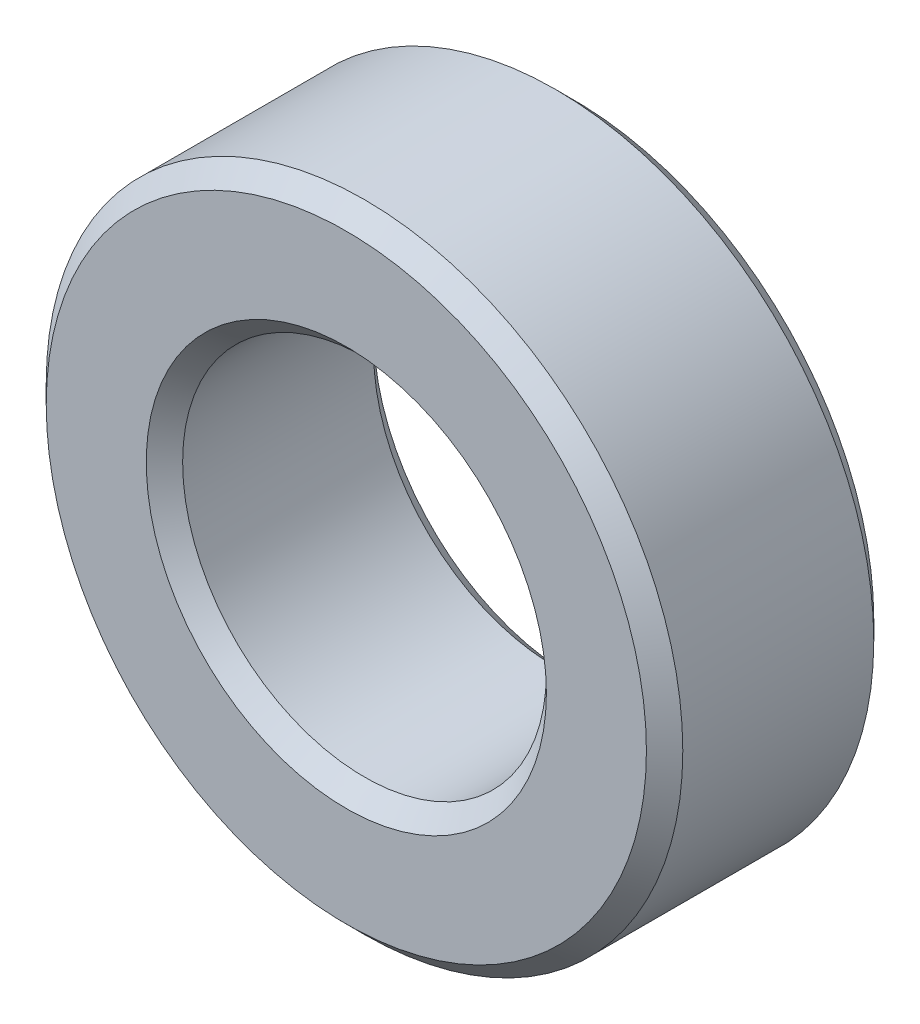
ISO-10303-21;
HEADER;
FILE_DESCRIPTION(('STEP AP214'),'2;1');
FILE_NAME('part.step','',(''),(''),'','','');
FILE_SCHEMA(('AUTOMOTIVE_DESIGN { 1 0 10303 214 1 1 1 1 }'));
ENDSEC;
DATA;
#1=APPLICATION_CONTEXT('core data for automotive mechanical design processes');
#2=APPLICATION_PROTOCOL_DEFINITION('international standard','automotive_design',2000,#1);
#3=PRODUCT_CONTEXT('',#1,'mechanical');
#4=PRODUCT('Part','Part','',(#3));
#5=PRODUCT_RELATED_PRODUCT_CATEGORY('part','',(#4));
#6=PRODUCT_DEFINITION_FORMATION('','',#4);
#7=PRODUCT_DEFINITION_CONTEXT('part definition',#1,'design');
#8=PRODUCT_DEFINITION('design','',#6,#7);
#9=PRODUCT_DEFINITION_SHAPE('','',#8);
#10=(LENGTH_UNIT() NAMED_UNIT(*) SI_UNIT(.MILLI.,.METRE.));
#11=(NAMED_UNIT(*) PLANE_ANGLE_UNIT() SI_UNIT($,.RADIAN.));
#12=(NAMED_UNIT(*) SI_UNIT($,.STERADIAN.) SOLID_ANGLE_UNIT());
#13=UNCERTAINTY_MEASURE_WITH_UNIT(LENGTH_MEASURE(1.E-05),#10,'distance_accuracy_value','');
#14=(GEOMETRIC_REPRESENTATION_CONTEXT(3) GLOBAL_UNCERTAINTY_ASSIGNED_CONTEXT((#13)) GLOBAL_UNIT_ASSIGNED_CONTEXT((#10,
#11,#12)) REPRESENTATION_CONTEXT('',''));
#15=CARTESIAN_POINT('',(0.,0.,0.));
#16=DIRECTION('',(0.,0.,1.));
#17=DIRECTION('',(1.,0.,0.));
#18=AXIS2_PLACEMENT_3D('',#15,#16,#17);
#19=CARTESIAN_POINT('',(0.,0.,2.5));
#20=DIRECTION('',(0.,0.,1.));
#21=DIRECTION('',(1.,0.,0.));
#22=AXIS2_PLACEMENT_3D('',#19,#20,#21);
#23=PLANE('',#22);
#24=CARTESIAN_POINT('',(0.,0.,2.5));
#25=DIRECTION('',(0.,0.,1.));
#26=DIRECTION('',(1.,0.,0.));
#27=AXIS2_PLACEMENT_3D('',#24,#25,#26);
#28=CIRCLE('',#27,2.2);
#29=CARTESIAN_POINT('',(2.2,0.,2.5));
#30=VERTEX_POINT('',#29);
#31=EDGE_CURVE('E10',#30,#30,#28,.F.);
#32=ORIENTED_EDGE('',*,*,#31,.T.);
#33=EDGE_LOOP('',(#32));
#34=FACE_BOUND('',#33,.T.);
#35=CARTESIAN_POINT('',(0.,0.,2.5));
#36=DIRECTION('',(0.,0.,1.));
#37=DIRECTION('',(1.,0.,0.));
#38=AXIS2_PLACEMENT_3D('',#35,#36,#37);
#39=CIRCLE('',#38,3.3);
#40=CARTESIAN_POINT('',(3.3,0.,2.5));
#41=VERTEX_POINT('',#40);
#42=EDGE_CURVE('E41',#41,#41,#39,.T.);
#43=ORIENTED_EDGE('',*,*,#42,.T.);
#44=EDGE_LOOP('',(#43));
#45=FACE_BOUND('',#44,.T.);
#46=ADVANCED_FACE('F33',(#34,#45),#23,.T.);
#47=CARTESIAN_POINT('',(0.,0.,0.));
#48=DIRECTION('',(0.,0.,1.));
#49=DIRECTION('',(1.,0.,0.));
#50=AXIS2_PLACEMENT_3D('',#47,#48,#49);
#51=PLANE('',#50);
#52=CARTESIAN_POINT('',(0.,0.,0.));
#53=DIRECTION('',(0.,0.,1.));
#54=DIRECTION('',(1.,0.,0.));
#55=AXIS2_PLACEMENT_3D('',#52,#53,#54);
#56=CIRCLE('',#55,2.2);
#57=CARTESIAN_POINT('',(2.2,0.,0.));
#58=VERTEX_POINT('',#57);
#59=EDGE_CURVE('E60',#58,#58,#56,.T.);
#60=ORIENTED_EDGE('',*,*,#59,.T.);
#61=EDGE_LOOP('',(#60));
#62=FACE_BOUND('',#61,.T.);
#63=CARTESIAN_POINT('',(0.,0.,0.));
#64=DIRECTION('',(0.,0.,1.));
#65=DIRECTION('',(1.,0.,0.));
#66=AXIS2_PLACEMENT_3D('',#63,#64,#65);
#67=CIRCLE('',#66,3.3);
#68=CARTESIAN_POINT('',(3.3,0.,0.));
#69=VERTEX_POINT('',#68);
#70=EDGE_CURVE('E63',#69,#69,#67,.F.);
#71=ORIENTED_EDGE('',*,*,#70,.T.);
#72=EDGE_LOOP('',(#71));
#73=FACE_BOUND('',#72,.T.);
#74=ADVANCED_FACE('F67',(#62,#73),#51,.F.);
#75=CARTESIAN_POINT('',(0.,0.,2.5));
#76=DIRECTION('',(0.,0.,-1.));
#77=DIRECTION('',(-1.,0.,0.));
#78=AXIS2_PLACEMENT_3D('',#75,#76,#77);
#79=CYLINDRICAL_SURFACE('',#78,3.5);
#80=CARTESIAN_POINT('',(0.,0.,0.2));
#81=DIRECTION('',(0.,0.,1.));
#82=DIRECTION('',(1.,0.,0.));
#83=AXIS2_PLACEMENT_3D('',#80,#81,#82);
#84=CIRCLE('',#83,3.5);
#85=CARTESIAN_POINT('',(3.5,0.,0.2));
#86=VERTEX_POINT('',#85);
#87=EDGE_CURVE('E45',#86,#86,#84,.T.);
#88=ORIENTED_EDGE('',*,*,#87,.T.);
#89=EDGE_LOOP('',(#88));
#90=FACE_BOUND('',#89,.T.);
#91=CARTESIAN_POINT('',(0.,0.,2.3));
#92=DIRECTION('',(0.,0.,1.));
#93=DIRECTION('',(1.,0.,0.));
#94=AXIS2_PLACEMENT_3D('',#91,#92,#93);
#95=CIRCLE('',#94,3.5);
#96=CARTESIAN_POINT('',(3.5,0.,2.3));
#97=VERTEX_POINT('',#96);
#98=EDGE_CURVE('E49',#97,#97,#95,.F.);
#99=ORIENTED_EDGE('',*,*,#98,.T.);
#100=EDGE_LOOP('',(#99));
#101=FACE_BOUND('',#100,.T.);
#102=ADVANCED_FACE('F77',(#90,#101),#79,.T.);
#103=CARTESIAN_POINT('',(0.,0.,2.5));
#104=DIRECTION('',(0.,0.,-1.));
#105=DIRECTION('',(-1.,0.,0.));
#106=AXIS2_PLACEMENT_3D('',#103,#104,#105);
#107=CYLINDRICAL_SURFACE('',#106,2.);
#108=CARTESIAN_POINT('',(0.,0.,0.200000000000001));
#109=DIRECTION('',(0.,0.,1.));
#110=DIRECTION('',(1.,0.,0.));
#111=AXIS2_PLACEMENT_3D('',#108,#109,#110);
#112=CIRCLE('',#111,2.);
#113=CARTESIAN_POINT('',(2.,0.,0.200000000000001));
#114=VERTEX_POINT('',#113);
#115=EDGE_CURVE('E54',#114,#114,#112,.F.);
#116=ORIENTED_EDGE('',*,*,#115,.T.);
#117=EDGE_LOOP('',(#116));
#118=FACE_BOUND('',#117,.T.);
#119=CARTESIAN_POINT('',(0.,0.,2.3));
#120=DIRECTION('',(0.,0.,1.));
#121=DIRECTION('',(1.,0.,0.));
#122=AXIS2_PLACEMENT_3D('',#119,#120,#121);
#123=CIRCLE('',#122,2.);
#124=CARTESIAN_POINT('',(2.,0.,2.3));
#125=VERTEX_POINT('',#124);
#126=EDGE_CURVE('E57',#125,#125,#123,.T.);
#127=ORIENTED_EDGE('',*,*,#126,.T.);
#128=EDGE_LOOP('',(#127));
#129=FACE_BOUND('',#128,.T.);
#130=ADVANCED_FACE('F80',(#118,#129),#107,.F.);
#131=CARTESIAN_POINT('',(0.,0.,0.));
#132=DIRECTION('',(0.,0.,-1.));
#133=DIRECTION('',(-1.,0.,0.));
#134=AXIS2_PLACEMENT_3D('',#131,#132,#133);
#135=CONICAL_SURFACE('',#134,2.2,0.785398163397444);
#136=ORIENTED_EDGE('',*,*,#115,.F.);
#137=EDGE_LOOP('',(#136));
#138=FACE_BOUND('',#137,.T.);
#139=ORIENTED_EDGE('',*,*,#59,.F.);
#140=EDGE_LOOP('',(#139));
#141=FACE_BOUND('',#140,.T.);
#142=ADVANCED_FACE('F73',(#138,#141),#135,.F.);
#143=CARTESIAN_POINT('',(0.,0.,0.2));
#144=DIRECTION('',(0.,0.,1.));
#145=DIRECTION('',(1.,0.,0.));
#146=AXIS2_PLACEMENT_3D('',#143,#144,#145);
#147=CONICAL_SURFACE('',#146,3.5,0.78539816339745);
#148=ORIENTED_EDGE('',*,*,#70,.F.);
#149=EDGE_LOOP('',(#148));
#150=FACE_BOUND('',#149,.T.);
#151=ORIENTED_EDGE('',*,*,#87,.F.);
#152=EDGE_LOOP('',(#151));
#153=FACE_BOUND('',#152,.T.);
#154=ADVANCED_FACE('F69',(#150,#153),#147,.T.);
#155=CARTESIAN_POINT('',(0.,0.,2.3));
#156=DIRECTION('',(0.,0.,1.));
#157=DIRECTION('',(1.,0.,0.));
#158=AXIS2_PLACEMENT_3D('',#155,#156,#157);
#159=CONICAL_SURFACE('',#158,2.,0.785398163397451);
#160=ORIENTED_EDGE('',*,*,#31,.F.);
#161=EDGE_LOOP('',(#160));
#162=FACE_BOUND('',#161,.T.);
#163=ORIENTED_EDGE('',*,*,#126,.F.);
#164=EDGE_LOOP('',(#163));
#165=FACE_BOUND('',#164,.T.);
#166=ADVANCED_FACE('F72',(#162,#165),#159,.F.);
#167=CARTESIAN_POINT('',(0.,0.,2.5));
#168=DIRECTION('',(0.,0.,-1.));
#169=DIRECTION('',(-1.,0.,0.));
#170=AXIS2_PLACEMENT_3D('',#167,#168,#169);
#171=CONICAL_SURFACE('',#170,3.3,0.785398163397445);
#172=ORIENTED_EDGE('',*,*,#98,.F.);
#173=EDGE_LOOP('',(#172));
#174=FACE_BOUND('',#173,.T.);
#175=ORIENTED_EDGE('',*,*,#42,.F.);
#176=EDGE_LOOP('',(#175));
#177=FACE_BOUND('',#176,.T.);
#178=ADVANCED_FACE('F36',(#174,#177),#171,.T.);
#179=CLOSED_SHELL('',(#46,#74,#102,#130,#142,#154,#166,#178));
#180=MANIFOLD_SOLID_BREP('B2',#179);
#181=ADVANCED_BREP_SHAPE_REPRESENTATION('',(#18,#180),#14);
#182=SHAPE_DEFINITION_REPRESENTATION(#9,#181);
ENDSEC;
END-ISO-10303-21;
